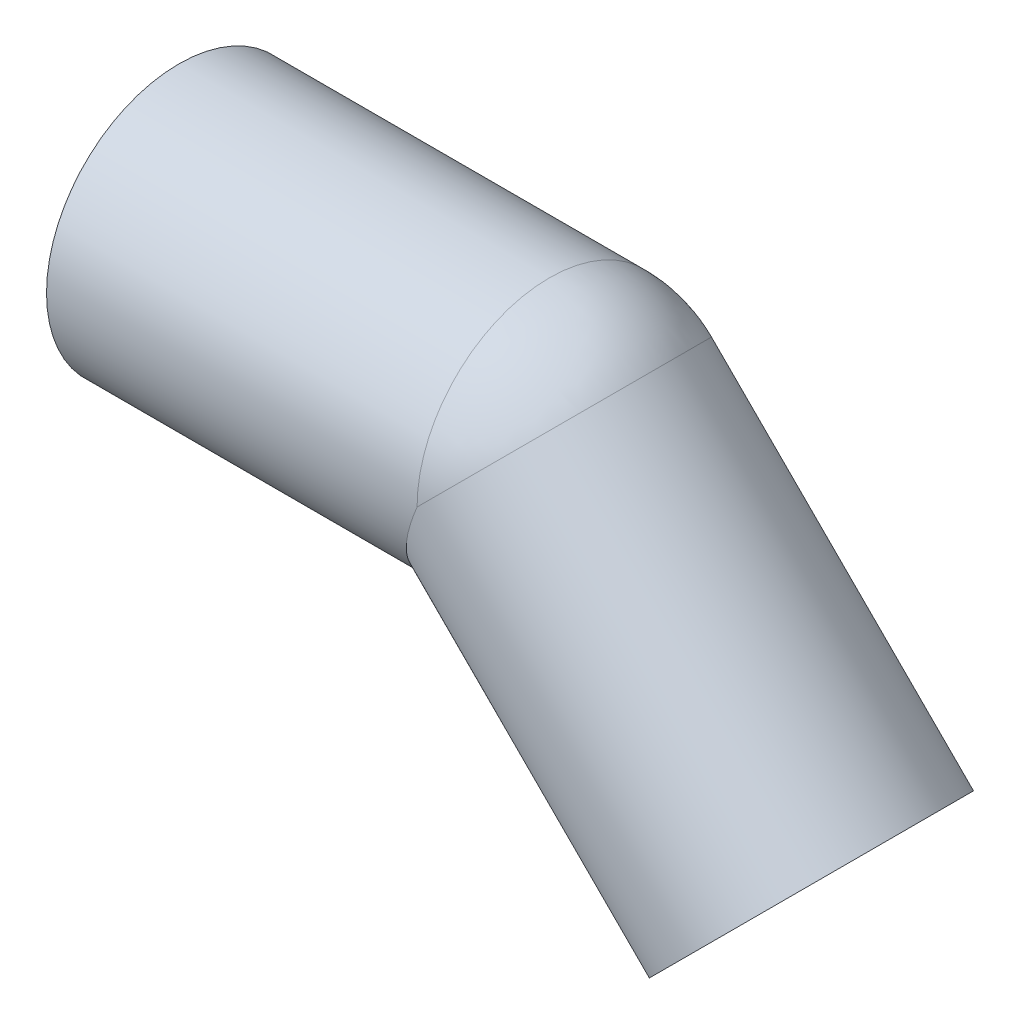
ISO-10303-21;
HEADER;
FILE_DESCRIPTION(('STEP AP214'),'2;1');
FILE_NAME('part.step','',(''),(''),'','','');
FILE_SCHEMA(('AUTOMOTIVE_DESIGN { 1 0 10303 214 1 1 1 1 }'));
ENDSEC;
DATA;
#1=APPLICATION_CONTEXT('core data for automotive mechanical design processes');
#2=APPLICATION_PROTOCOL_DEFINITION('international standard','automotive_design',2000,#1);
#3=PRODUCT_CONTEXT('',#1,'mechanical');
#4=PRODUCT('Part','Part','',(#3));
#5=PRODUCT_RELATED_PRODUCT_CATEGORY('part','',(#4));
#6=PRODUCT_DEFINITION_FORMATION('','',#4);
#7=PRODUCT_DEFINITION_CONTEXT('part definition',#1,'design');
#8=PRODUCT_DEFINITION('design','',#6,#7);
#9=PRODUCT_DEFINITION_SHAPE('','',#8);
#10=(LENGTH_UNIT() NAMED_UNIT(*) SI_UNIT(.MILLI.,.METRE.));
#11=(NAMED_UNIT(*) PLANE_ANGLE_UNIT() SI_UNIT($,.RADIAN.));
#12=(NAMED_UNIT(*) SI_UNIT($,.STERADIAN.) SOLID_ANGLE_UNIT());
#13=UNCERTAINTY_MEASURE_WITH_UNIT(LENGTH_MEASURE(1.E-05),#10,'distance_accuracy_value','');
#14=(GEOMETRIC_REPRESENTATION_CONTEXT(3) GLOBAL_UNCERTAINTY_ASSIGNED_CONTEXT((#13)) GLOBAL_UNIT_ASSIGNED_CONTEXT((#10,
#11,#12)) REPRESENTATION_CONTEXT('',''));
#15=CARTESIAN_POINT('',(0.,0.,0.));
#16=DIRECTION('',(0.,0.,1.));
#17=DIRECTION('',(1.,0.,0.));
#18=AXIS2_PLACEMENT_3D('',#15,#16,#17);
#19=CARTESIAN_POINT('',(119.497474683058,-49.49747468306,0.));
#20=DIRECTION('',(-0.707106781186518,0.707106781186577,0.));
#21=DIRECTION('',(-0.707106781186577,-0.707106781186518,0.));
#22=AXIS2_PLACEMENT_3D('',#19,#20,#21);
#23=CYLINDRICAL_SURFACE('',#22,20.4);
#24=CARTESIAN_POINT('',(70.,0.,0.));
#25=DIRECTION('',(0.707106781186547,-0.707106781186548,0.));
#26=DIRECTION('',(0.,0.,-1.));
#27=AXIS2_PLACEMENT_3D('',#24,#25,#26);
#28=CIRCLE('',#27,20.4);
#29=CARTESIAN_POINT('',(84.4249783375978,14.4249783348133,0.));
#30=VERTEX_POINT('',#29);
#31=CARTESIAN_POINT('',(70.0000000000018,-7.03359907719382E-13,20.4));
#32=VERTEX_POINT('',#31);
#33=EDGE_CURVE('E50',#30,#32,#28,.T.);
#34=ORIENTED_EDGE('',*,*,#33,.F.);
#35=CARTESIAN_POINT('',(70.,0.,0.));
#36=DIRECTION('',(0.707106780981804,-0.707106781391292,0.));
#37=DIRECTION('',(0.,0.,-1.));
#38=AXIS2_PLACEMENT_3D('',#35,#36,#37);
#39=CIRCLE('',#38,20.4);
#40=CARTESIAN_POINT('',(70.0000000000017,-6.94054920049245E-13,-20.4));
#41=VERTEX_POINT('',#40);
#42=EDGE_CURVE('E43',#41,#30,#39,.T.);
#43=ORIENTED_EDGE('',*,*,#42,.F.);
#44=CARTESIAN_POINT('',(70.000000000002,0.,0.));
#45=DIRECTION('',(-0.923879532511279,0.382683432365109,0.));
#46=DIRECTION('',(-0.382683432365109,-0.923879532511279,0.));
#47=AXIS2_PLACEMENT_3D('',#44,#45,#46);
#48=ELLIPSE('',#47,22.080800885965,20.4);
#49=EDGE_CURVE('E52',#32,#41,#48,.F.);
#50=ORIENTED_EDGE('',*,*,#49,.F.);
#51=EDGE_LOOP('',(#34,#43,#50));
#52=FACE_BOUND('',#51,.T.);
#53=CARTESIAN_POINT('',(119.497474683057,-49.4974746830588,0.));
#54=DIRECTION('',(-0.707106781186518,0.707106781186577,0.));
#55=DIRECTION('',(-0.707106781186577,-0.707106781186518,0.));
#56=AXIS2_PLACEMENT_3D('',#53,#54,#55);
#57=CIRCLE('',#56,20.4);
#58=CARTESIAN_POINT('',(105.07249634685,-63.9224530192638,0.));
#59=VERTEX_POINT('',#58);
#60=EDGE_CURVE('E18',#59,#59,#57,.T.);
#61=ORIENTED_EDGE('',*,*,#60,.F.);
#62=EDGE_LOOP('',(#61));
#63=FACE_BOUND('',#62,.T.);
#64=ADVANCED_FACE('F15',(#52,#63),#23,.F.);
#65=CARTESIAN_POINT('',(70.,0.,0.));
#66=DIRECTION('',(0.,0.,1.));
#67=DIRECTION('',(-1.,0.,0.));
#68=AXIS2_PLACEMENT_3D('',#65,#66,#67);
#69=SPHERICAL_SURFACE('',#68,20.4);
#70=CARTESIAN_POINT('',(70.,0.,0.));
#71=DIRECTION('',(-1.,0.,0.));
#72=DIRECTION('',(0.,1.,0.));
#73=AXIS2_PLACEMENT_3D('',#70,#71,#72);
#74=CIRCLE('',#73,20.4);
#75=EDGE_CURVE('E48',#41,#32,#74,.F.);
#76=ORIENTED_EDGE('',*,*,#75,.F.);
#77=ORIENTED_EDGE('',*,*,#42,.T.);
#78=ORIENTED_EDGE('',*,*,#33,.T.);
#79=EDGE_LOOP('',(#76,#77,#78));
#80=FACE_BOUND('',#79,.T.);
#81=ADVANCED_FACE('F55',(#80),#69,.F.);
#82=CARTESIAN_POINT('',(137.175144212727,-31.8198051533901,25.3000021083536));
#83=DIRECTION('',(0.707106781186547,-0.707106781186548,0.));
#84=DIRECTION('',(-0.707106781186548,-0.707106781186547,0.));
#85=AXIS2_PLACEMENT_3D('',#82,#83,#84);
#86=PLANE('',#85);
#87=ORIENTED_EDGE('',*,*,#60,.T.);
#88=EDGE_LOOP('',(#87));
#89=FACE_BOUND('',#88,.T.);
#90=CARTESIAN_POINT('',(119.497474683057,-49.4974746830587,0.));
#91=DIRECTION('',(-0.707106781186518,0.707106781186577,0.));
#92=DIRECTION('',(-0.707106781186577,-0.707106781186518,0.));
#93=AXIS2_PLACEMENT_3D('',#90,#91,#92);
#94=CIRCLE('',#93,25.0000000000001);
#95=CARTESIAN_POINT('',(101.819805153392,-67.1751442127216,0.));
#96=VERTEX_POINT('',#95);
#97=EDGE_CURVE('E68',#96,#96,#94,.T.);
#98=ORIENTED_EDGE('',*,*,#97,.F.);
#99=EDGE_LOOP('',(#98));
#100=FACE_BOUND('',#99,.T.);
#101=ADVANCED_FACE('F77',(#89,#100),#86,.T.);
#102=CARTESIAN_POINT('',(70.,0.,0.));
#103=DIRECTION('',(-1.,0.,0.));
#104=DIRECTION('',(0.,0.,1.));
#105=AXIS2_PLACEMENT_3D('',#102,#103,#104);
#106=CYLINDRICAL_SURFACE('',#105,20.4);
#107=CARTESIAN_POINT('',(0.,0.,0.));
#108=DIRECTION('',(-1.,0.,0.));
#109=DIRECTION('',(0.,0.,1.));
#110=AXIS2_PLACEMENT_3D('',#107,#108,#109);
#111=CIRCLE('',#110,20.4);
#112=CARTESIAN_POINT('',(0.,0.,20.4));
#113=VERTEX_POINT('',#112);
#114=EDGE_CURVE('E65',#113,#113,#111,.F.);
#115=ORIENTED_EDGE('',*,*,#114,.F.);
#116=EDGE_LOOP('',(#115));
#117=FACE_BOUND('',#116,.T.);
#118=ORIENTED_EDGE('',*,*,#49,.T.);
#119=ORIENTED_EDGE('',*,*,#75,.T.);
#120=EDGE_LOOP('',(#118,#119));
#121=FACE_BOUND('',#120,.T.);
#122=ADVANCED_FACE('F80',(#117,#121),#106,.F.);
#123=CARTESIAN_POINT('',(70.,0.,0.));
#124=DIRECTION('',(0.,0.,1.));
#125=DIRECTION('',(1.,0.,0.));
#126=AXIS2_PLACEMENT_3D('',#123,#124,#125);
#127=SPHERICAL_SURFACE('',#126,25.);
#128=CARTESIAN_POINT('',(70.,0.,0.));
#129=DIRECTION('',(-1.,0.,0.));
#130=DIRECTION('',(0.,1.,0.));
#131=AXIS2_PLACEMENT_3D('',#128,#129,#130);
#132=CIRCLE('',#131,25.);
#133=CARTESIAN_POINT('',(70.0000000000017,-7.19045368242774E-13,25.));
#134=VERTEX_POINT('',#133);
#135=CARTESIAN_POINT('',(70.0000000000017,-7.2267217391368E-13,-24.9999999999997));
#136=VERTEX_POINT('',#135);
#137=EDGE_CURVE('E64',#134,#136,#132,.T.);
#138=ORIENTED_EDGE('',*,*,#137,.F.);
#139=CARTESIAN_POINT('',(70.000000000001,1.0096090630185E-12,0.));
#140=DIRECTION('',(-0.707106781186518,0.707106781186577,0.));
#141=DIRECTION('',(0.707106781186577,0.707106781186518,0.));
#142=AXIS2_PLACEMENT_3D('',#139,#140,#141);
#143=CIRCLE('',#142,24.9999999999986);
#144=EDGE_CURVE('E32',#136,#134,#143,.F.);
#145=ORIENTED_EDGE('',*,*,#144,.F.);
#146=EDGE_LOOP('',(#138,#145));
#147=FACE_BOUND('',#146,.T.);
#148=ADVANCED_FACE('F84',(#147),#127,.T.);
#149=CARTESIAN_POINT('',(70.000000000001,1.02695629777827E-12,0.));
#150=DIRECTION('',(-0.707106781186518,0.707106781186577,0.));
#151=DIRECTION('',(-0.707106781186577,-0.707106781186518,0.));
#152=AXIS2_PLACEMENT_3D('',#149,#150,#151);
#153=CYLINDRICAL_SURFACE('',#152,25.0000000000001);
#154=ORIENTED_EDGE('',*,*,#97,.T.);
#155=EDGE_LOOP('',(#154));
#156=FACE_BOUND('',#155,.T.);
#157=CARTESIAN_POINT('',(70.000000000002,0.,0.));
#158=DIRECTION('',(-0.923879532511279,0.382683432365109,0.));
#159=DIRECTION('',(-0.382683432365109,-0.923879532511279,0.));
#160=AXIS2_PLACEMENT_3D('',#157,#158,#159);
#161=ELLIPSE('',#160,27.0598050073101,25.);
#162=EDGE_CURVE('E24',#136,#134,#161,.T.);
#163=ORIENTED_EDGE('',*,*,#162,.F.);
#164=ORIENTED_EDGE('',*,*,#144,.T.);
#165=EDGE_LOOP('',(#163,#164));
#166=FACE_BOUND('',#165,.T.);
#167=ADVANCED_FACE('F88',(#156,#166),#153,.T.);
#168=CARTESIAN_POINT('',(0.,-25.,25.3000021084363));
#169=DIRECTION('',(-1.,0.,0.));
#170=DIRECTION('',(0.,1.,0.));
#171=AXIS2_PLACEMENT_3D('',#168,#169,#170);
#172=PLANE('',#171);
#173=ORIENTED_EDGE('',*,*,#114,.T.);
#174=EDGE_LOOP('',(#173));
#175=FACE_BOUND('',#174,.T.);
#176=CARTESIAN_POINT('',(0.,0.,0.));
#177=DIRECTION('',(-1.,0.,0.));
#178=DIRECTION('',(0.,0.,1.));
#179=AXIS2_PLACEMENT_3D('',#176,#177,#178);
#180=CIRCLE('',#179,25.);
#181=CARTESIAN_POINT('',(0.,0.,25.));
#182=VERTEX_POINT('',#181);
#183=EDGE_CURVE('E9',#182,#182,#180,.F.);
#184=ORIENTED_EDGE('',*,*,#183,.F.);
#185=EDGE_LOOP('',(#184));
#186=FACE_BOUND('',#185,.T.);
#187=ADVANCED_FACE('F91',(#175,#186),#172,.T.);
#188=CARTESIAN_POINT('',(0.,0.,0.));
#189=DIRECTION('',(-1.,0.,0.));
#190=DIRECTION('',(0.,0.,1.));
#191=AXIS2_PLACEMENT_3D('',#188,#189,#190);
#192=CYLINDRICAL_SURFACE('',#191,25.);
#193=ORIENTED_EDGE('',*,*,#162,.T.);
#194=ORIENTED_EDGE('',*,*,#137,.T.);
#195=EDGE_LOOP('',(#193,#194));
#196=FACE_BOUND('',#195,.T.);
#197=ORIENTED_EDGE('',*,*,#183,.T.);
#198=EDGE_LOOP('',(#197));
#199=FACE_BOUND('',#198,.T.);
#200=ADVANCED_FACE('F95',(#196,#199),#192,.T.);
#201=CLOSED_SHELL('',(#64,#81,#101,#122,#148,#167,#187,#200));
#202=MANIFOLD_SOLID_BREP('B1',#201);
#203=ADVANCED_BREP_SHAPE_REPRESENTATION('',(#18,#202),#14);
#204=SHAPE_DEFINITION_REPRESENTATION(#9,#203);
ENDSEC;
END-ISO-10303-21;
